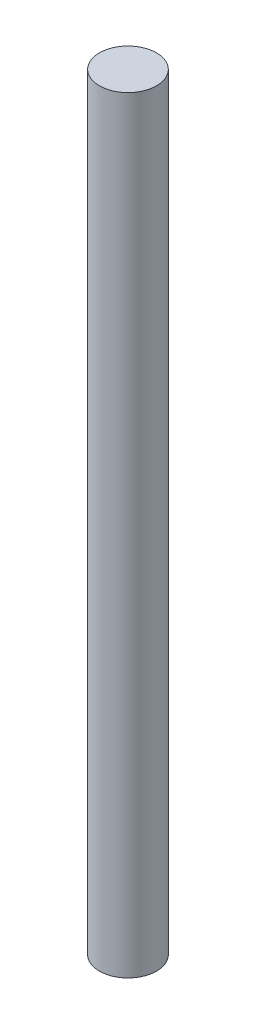
ISO-10303-21;
HEADER;
FILE_DESCRIPTION(('STEP AP214'),'2;1');
FILE_NAME('part.step','',(''),(''),'','','');
FILE_SCHEMA(('AUTOMOTIVE_DESIGN { 1 0 10303 214 1 1 1 1 }'));
ENDSEC;
DATA;
#1=APPLICATION_CONTEXT('core data for automotive mechanical design processes');
#2=APPLICATION_PROTOCOL_DEFINITION('international standard','automotive_design',2000,#1);
#3=PRODUCT_CONTEXT('',#1,'mechanical');
#4=PRODUCT('Part','Part','',(#3));
#5=PRODUCT_RELATED_PRODUCT_CATEGORY('part','',(#4));
#6=PRODUCT_DEFINITION_FORMATION('','',#4);
#7=PRODUCT_DEFINITION_CONTEXT('part definition',#1,'design');
#8=PRODUCT_DEFINITION('design','',#6,#7);
#9=PRODUCT_DEFINITION_SHAPE('','',#8);
#10=(LENGTH_UNIT() NAMED_UNIT(*) SI_UNIT(.MILLI.,.METRE.));
#11=(NAMED_UNIT(*) PLANE_ANGLE_UNIT() SI_UNIT($,.RADIAN.));
#12=(NAMED_UNIT(*) SI_UNIT($,.STERADIAN.) SOLID_ANGLE_UNIT());
#13=UNCERTAINTY_MEASURE_WITH_UNIT(LENGTH_MEASURE(1.E-05),#10,'distance_accuracy_value','');
#14=(GEOMETRIC_REPRESENTATION_CONTEXT(3) GLOBAL_UNCERTAINTY_ASSIGNED_CONTEXT((#13)) GLOBAL_UNIT_ASSIGNED_CONTEXT((#10,
#11,#12)) REPRESENTATION_CONTEXT('',''));
#15=CARTESIAN_POINT('',(0.,0.,0.));
#16=DIRECTION('',(0.,0.,1.));
#17=DIRECTION('',(1.,0.,0.));
#18=AXIS2_PLACEMENT_3D('',#15,#16,#17);
#19=CARTESIAN_POINT('',(0.,47.,0.));
#20=DIRECTION('',(0.,-1.,0.));
#21=DIRECTION('',(0.,0.,-1.));
#22=AXIS2_PLACEMENT_3D('',#19,#20,#21);
#23=CYLINDRICAL_SURFACE('',#22,1.75);
#24=CARTESIAN_POINT('',(0.,47.,0.));
#25=DIRECTION('',(0.,1.,0.));
#26=DIRECTION('',(0.,0.,1.));
#27=AXIS2_PLACEMENT_3D('',#24,#25,#26);
#28=CIRCLE('',#27,1.75);
#29=CARTESIAN_POINT('',(0.,47.,1.75));
#30=VERTEX_POINT('',#29);
#31=EDGE_CURVE('E10',#30,#30,#28,.T.);
#32=ORIENTED_EDGE('',*,*,#31,.F.);
#33=EDGE_LOOP('',(#32));
#34=FACE_BOUND('',#33,.T.);
#35=CARTESIAN_POINT('',(0.,0.,0.));
#36=DIRECTION('',(0.,1.,0.));
#37=DIRECTION('',(0.,0.,1.));
#38=AXIS2_PLACEMENT_3D('',#35,#36,#37);
#39=CIRCLE('',#38,1.75);
#40=CARTESIAN_POINT('',(0.,0.,1.75));
#41=VERTEX_POINT('',#40);
#42=EDGE_CURVE('E35',#41,#41,#39,.T.);
#43=ORIENTED_EDGE('',*,*,#42,.T.);
#44=EDGE_LOOP('',(#43));
#45=FACE_BOUND('',#44,.T.);
#46=ADVANCED_FACE('F32',(#34,#45),#23,.T.);
#47=CARTESIAN_POINT('',(0.,47.,0.));
#48=DIRECTION('',(0.,1.,0.));
#49=DIRECTION('',(0.,0.,1.));
#50=AXIS2_PLACEMENT_3D('',#47,#48,#49);
#51=PLANE('',#50);
#52=ORIENTED_EDGE('',*,*,#31,.T.);
#53=EDGE_LOOP('',(#52));
#54=FACE_BOUND('',#53,.T.);
#55=ADVANCED_FACE('F47',(#54),#51,.T.);
#56=CARTESIAN_POINT('',(0.,0.,0.));
#57=DIRECTION('',(0.,1.,0.));
#58=DIRECTION('',(0.,0.,1.));
#59=AXIS2_PLACEMENT_3D('',#56,#57,#58);
#60=PLANE('',#59);
#61=ORIENTED_EDGE('',*,*,#42,.F.);
#62=EDGE_LOOP('',(#61));
#63=FACE_BOUND('',#62,.T.);
#64=ADVANCED_FACE('F45',(#63),#60,.F.);
#65=CLOSED_SHELL('',(#46,#55,#64));
#66=MANIFOLD_SOLID_BREP('B2',#65);
#67=ADVANCED_BREP_SHAPE_REPRESENTATION('',(#18,#66),#14);
#68=SHAPE_DEFINITION_REPRESENTATION(#9,#67);
ENDSEC;
END-ISO-10303-21;
